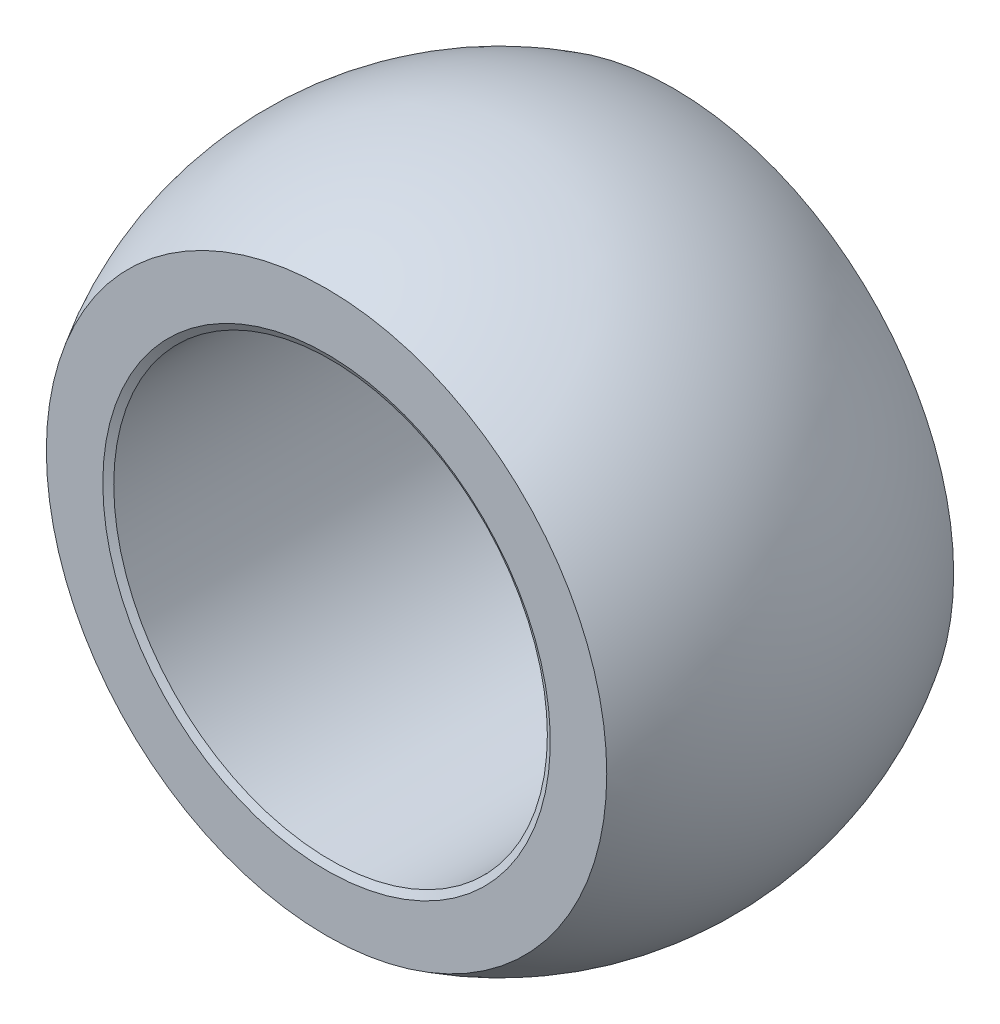
ISO-10303-21;
HEADER;
FILE_DESCRIPTION(('STEP AP214'),'2;1');
FILE_NAME('part.step','',(''),(''),'','','');
FILE_SCHEMA(('AUTOMOTIVE_DESIGN { 1 0 10303 214 1 1 1 1 }'));
ENDSEC;
DATA;
#1=APPLICATION_CONTEXT('core data for automotive mechanical design processes');
#2=APPLICATION_PROTOCOL_DEFINITION('international standard','automotive_design',2000,#1);
#3=PRODUCT_CONTEXT('',#1,'mechanical');
#4=PRODUCT('Part','Part','',(#3));
#5=PRODUCT_RELATED_PRODUCT_CATEGORY('part','',(#4));
#6=PRODUCT_DEFINITION_FORMATION('','',#4);
#7=PRODUCT_DEFINITION_CONTEXT('part definition',#1,'design');
#8=PRODUCT_DEFINITION('design','',#6,#7);
#9=PRODUCT_DEFINITION_SHAPE('','',#8);
#10=(LENGTH_UNIT() NAMED_UNIT(*) SI_UNIT(.MILLI.,.METRE.));
#11=(NAMED_UNIT(*) PLANE_ANGLE_UNIT() SI_UNIT($,.RADIAN.));
#12=(NAMED_UNIT(*) SI_UNIT($,.STERADIAN.) SOLID_ANGLE_UNIT());
#13=UNCERTAINTY_MEASURE_WITH_UNIT(LENGTH_MEASURE(1.E-05),#10,'distance_accuracy_value','');
#14=(GEOMETRIC_REPRESENTATION_CONTEXT(3) GLOBAL_UNCERTAINTY_ASSIGNED_CONTEXT((#13)) GLOBAL_UNIT_ASSIGNED_CONTEXT((#10,
#11,#12)) REPRESENTATION_CONTEXT('',''));
#15=CARTESIAN_POINT('',(0.,0.,0.));
#16=DIRECTION('',(0.,0.,1.));
#17=DIRECTION('',(1.,0.,0.));
#18=AXIS2_PLACEMENT_3D('',#15,#16,#17);
#19=CARTESIAN_POINT('',(0.,0.,0.));
#20=DIRECTION('',(0.,1.,0.));
#21=DIRECTION('',(1.,0.,0.));
#22=AXIS2_PLACEMENT_3D('',#19,#20,#21);
#23=SPHERICAL_SURFACE('',#22,12.065);
#24=CARTESIAN_POINT('',(0.,0.,0.));
#25=DIRECTION('',(0.,0.,1.));
#26=DIRECTION('',(1.,0.,0.));
#27=AXIS2_PLACEMENT_3D('',#24,#25,#26);
#28=SPHERICAL_SURFACE('',#27,12.065);
#29=CARTESIAN_POINT('',(0.,0.,-6.35));
#30=DIRECTION('',(0.,0.,1.));
#31=DIRECTION('',(1.,0.,0.));
#32=AXIS2_PLACEMENT_3D('',#29,#30,#31);
#33=CIRCLE('',#32,10.2587389575912);
#34=CARTESIAN_POINT('',(10.2587389575912,0.,-6.35));
#35=VERTEX_POINT('',#34);
#36=EDGE_CURVE('E44',#35,#35,#33,.T.);
#37=ORIENTED_EDGE('',*,*,#36,.T.);
#38=EDGE_LOOP('',(#37));
#39=FACE_BOUND('',#38,.T.);
#40=CARTESIAN_POINT('',(0.,0.,6.35));
#41=DIRECTION('',(0.,0.,-1.));
#42=DIRECTION('',(-1.,0.,0.));
#43=AXIS2_PLACEMENT_3D('',#40,#41,#42);
#44=CIRCLE('',#43,10.2587389575912);
#45=CARTESIAN_POINT('',(-10.2587389575912,0.,6.35));
#46=VERTEX_POINT('',#45);
#47=EDGE_CURVE('E48',#46,#46,#44,.T.);
#48=ORIENTED_EDGE('',*,*,#47,.T.);
#49=EDGE_LOOP('',(#48));
#50=FACE_BOUND('',#49,.T.);
#51=ADVANCED_FACE('F33',(#39,#50),#28,.T.);
#52=CARTESIAN_POINT('',(-12.065,10.2587389575912,6.35));
#53=DIRECTION('',(0.,0.,-1.));
#54=DIRECTION('',(-1.,0.,0.));
#55=AXIS2_PLACEMENT_3D('',#52,#53,#54);
#56=PLANE('',#55);
#57=CARTESIAN_POINT('',(0.,0.,6.35));
#58=DIRECTION('',(0.,0.,-1.));
#59=DIRECTION('',(-1.,0.,0.));
#60=AXIS2_PLACEMENT_3D('',#57,#58,#59);
#61=CIRCLE('',#60,8.1915);
#62=CARTESIAN_POINT('',(-8.1915,0.,6.35));
#63=VERTEX_POINT('',#62);
#64=EDGE_CURVE('E10',#63,#63,#61,.T.);
#65=ORIENTED_EDGE('',*,*,#64,.T.);
#66=EDGE_LOOP('',(#65));
#67=FACE_BOUND('',#66,.T.);
#68=ORIENTED_EDGE('',*,*,#47,.F.);
#69=EDGE_LOOP('',(#68));
#70=FACE_BOUND('',#69,.T.);
#71=ADVANCED_FACE('F68',(#67,#70),#56,.F.);
#72=CARTESIAN_POINT('',(-12.065,10.2587389575912,-6.35));
#73=DIRECTION('',(0.,0.,1.));
#74=DIRECTION('',(1.,0.,0.));
#75=AXIS2_PLACEMENT_3D('',#72,#73,#74);
#76=PLANE('',#75);
#77=CARTESIAN_POINT('',(0.,0.,-6.35));
#78=DIRECTION('',(0.,0.,1.));
#79=DIRECTION('',(1.,0.,0.));
#80=AXIS2_PLACEMENT_3D('',#77,#78,#79);
#81=CIRCLE('',#80,7.9375);
#82=CARTESIAN_POINT('',(7.9375,0.,-6.35));
#83=VERTEX_POINT('',#82);
#84=EDGE_CURVE('E53',#83,#83,#81,.T.);
#85=ORIENTED_EDGE('',*,*,#84,.T.);
#86=EDGE_LOOP('',(#85));
#87=FACE_BOUND('',#86,.T.);
#88=ORIENTED_EDGE('',*,*,#36,.F.);
#89=EDGE_LOOP('',(#88));
#90=FACE_BOUND('',#89,.T.);
#91=ADVANCED_FACE('F57',(#87,#90),#76,.F.);
#92=CARTESIAN_POINT('',(0.,0.,-6.35));
#93=DIRECTION('',(0.,0.,1.));
#94=DIRECTION('',(1.,0.,0.));
#95=AXIS2_PLACEMENT_3D('',#92,#93,#94);
#96=CYLINDRICAL_SURFACE('',#95,7.9375);
#97=CARTESIAN_POINT('',(0.,0.,6.20335303162584));
#98=DIRECTION('',(0.,0.,-1.));
#99=DIRECTION('',(-1.,0.,0.));
#100=AXIS2_PLACEMENT_3D('',#97,#98,#99);
#101=CIRCLE('',#100,7.9375);
#102=CARTESIAN_POINT('',(-7.9375,0.,6.20335303162584));
#103=VERTEX_POINT('',#102);
#104=EDGE_CURVE('E40',#103,#103,#101,.F.);
#105=ORIENTED_EDGE('',*,*,#104,.T.);
#106=EDGE_LOOP('',(#105));
#107=FACE_BOUND('',#106,.T.);
#108=ORIENTED_EDGE('',*,*,#84,.F.);
#109=EDGE_LOOP('',(#108));
#110=FACE_BOUND('',#109,.T.);
#111=ADVANCED_FACE('F60',(#107,#110),#96,.F.);
#112=CARTESIAN_POINT('',(0.,0.,6.20335303162584));
#113=DIRECTION('',(0.,0.,1.));
#114=DIRECTION('',(1.,0.,0.));
#115=AXIS2_PLACEMENT_3D('',#112,#113,#114);
#116=CONICAL_SURFACE('',#115,7.9375,1.04719755119661);
#117=ORIENTED_EDGE('',*,*,#64,.F.);
#118=EDGE_LOOP('',(#117));
#119=FACE_BOUND('',#118,.T.);
#120=ORIENTED_EDGE('',*,*,#104,.F.);
#121=EDGE_LOOP('',(#120));
#122=FACE_BOUND('',#121,.T.);
#123=ADVANCED_FACE('F35',(#119,#122),#116,.F.);
#124=CLOSED_SHELL('',(#51,#71,#91,#111,#123));
#125=MANIFOLD_SOLID_BREP('B2',#124);
#126=ADVANCED_BREP_SHAPE_REPRESENTATION('',(#18,#125),#14);
#127=SHAPE_DEFINITION_REPRESENTATION(#9,#126);
ENDSEC;
END-ISO-10303-21;
